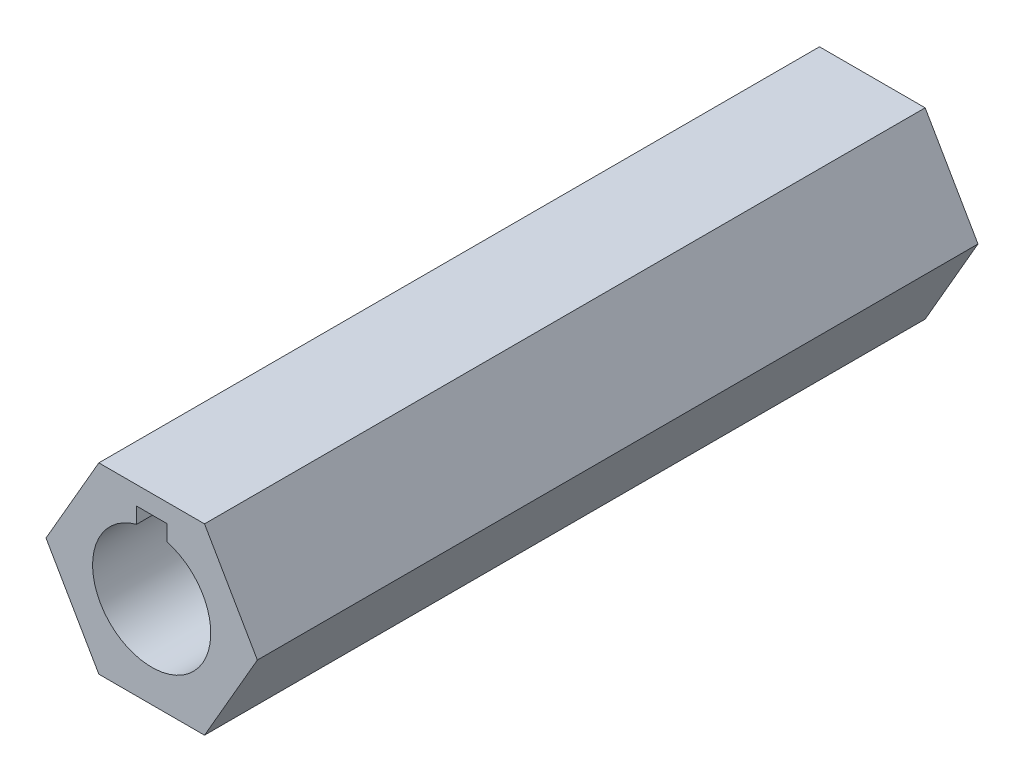
ISO-10303-21;
HEADER;
FILE_DESCRIPTION(('STEP AP214'),'2;1');
FILE_NAME('part.step','',(''),(''),'','','');
FILE_SCHEMA(('AUTOMOTIVE_DESIGN { 1 0 10303 214 1 1 1 1 }'));
ENDSEC;
DATA;
#1=APPLICATION_CONTEXT('core data for automotive mechanical design processes');
#2=APPLICATION_PROTOCOL_DEFINITION('international standard','automotive_design',2000,#1);
#3=PRODUCT_CONTEXT('',#1,'mechanical');
#4=PRODUCT('Part','Part','',(#3));
#5=PRODUCT_RELATED_PRODUCT_CATEGORY('part','',(#4));
#6=PRODUCT_DEFINITION_FORMATION('','',#4);
#7=PRODUCT_DEFINITION_CONTEXT('part definition',#1,'design');
#8=PRODUCT_DEFINITION('design','',#6,#7);
#9=PRODUCT_DEFINITION_SHAPE('','',#8);
#10=(LENGTH_UNIT() NAMED_UNIT(*) SI_UNIT(.MILLI.,.METRE.));
#11=(NAMED_UNIT(*) PLANE_ANGLE_UNIT() SI_UNIT($,.RADIAN.));
#12=(NAMED_UNIT(*) SI_UNIT($,.STERADIAN.) SOLID_ANGLE_UNIT());
#13=UNCERTAINTY_MEASURE_WITH_UNIT(LENGTH_MEASURE(1.E-05),#10,'distance_accuracy_value','');
#14=(GEOMETRIC_REPRESENTATION_CONTEXT(3) GLOBAL_UNCERTAINTY_ASSIGNED_CONTEXT((#13)) GLOBAL_UNIT_ASSIGNED_CONTEXT((#10,
#11,#12)) REPRESENTATION_CONTEXT('',''));
#15=CARTESIAN_POINT('',(0.,0.,0.));
#16=DIRECTION('',(0.,0.,1.));
#17=DIRECTION('',(1.,0.,0.));
#18=AXIS2_PLACEMENT_3D('',#15,#16,#17);
#19=CARTESIAN_POINT('',(3.6661742093542,-6.34999999999996,50.));
#20=DIRECTION('',(-0.866025403784441,0.499999999999995,0.));
#21=DIRECTION('',(-0.499999999999995,-0.866025403784442,0.));
#22=AXIS2_PLACEMENT_3D('',#19,#20,#21);
#23=PLANE('',#22);
#24=DIRECTION('',(0.499999999999995,0.866025403784441,0.));
#25=VECTOR('',#24,1.);
#26=CARTESIAN_POINT('',(3.6661742093542,-6.34999999999996,0.));
#27=LINE('',#26,#25);
#28=CARTESIAN_POINT('',(3.6661742093542,-6.34999999999996,0.));
#29=VERTEX_POINT('',#28);
#30=CARTESIAN_POINT('',(7.33234841870825,0.,0.));
#31=VERTEX_POINT('',#30);
#32=EDGE_CURVE('E149',#29,#31,#27,.T.);
#33=ORIENTED_EDGE('',*,*,#32,.T.);
#34=DIRECTION('',(0.,0.,-1.));
#35=VECTOR('',#34,1.);
#36=CARTESIAN_POINT('',(7.33234841870825,0.,50.));
#37=LINE('',#36,#35);
#38=CARTESIAN_POINT('',(7.33234841870825,0.,50.));
#39=VERTEX_POINT('',#38);
#40=EDGE_CURVE('E11',#39,#31,#37,.T.);
#41=ORIENTED_EDGE('',*,*,#40,.F.);
#42=DIRECTION('',(0.499999999999995,0.866025403784441,0.));
#43=VECTOR('',#42,1.);
#44=CARTESIAN_POINT('',(3.6661742093542,-6.34999999999996,50.));
#45=LINE('',#44,#43);
#46=CARTESIAN_POINT('',(3.6661742093542,-6.34999999999996,50.));
#47=VERTEX_POINT('',#46);
#48=EDGE_CURVE('E155',#47,#39,#45,.T.);
#49=ORIENTED_EDGE('',*,*,#48,.F.);
#50=DIRECTION('',(0.,0.,-1.));
#51=VECTOR('',#50,1.);
#52=CARTESIAN_POINT('',(3.6661742093542,-6.34999999999996,50.));
#53=LINE('',#52,#51);
#54=EDGE_CURVE('E168',#47,#29,#53,.T.);
#55=ORIENTED_EDGE('',*,*,#54,.T.);
#56=EDGE_LOOP('',(#33,#41,#49,#55));
#57=FACE_BOUND('',#56,.T.);
#58=ADVANCED_FACE('F39',(#57),#23,.F.);
#59=CARTESIAN_POINT('',(7.33234841870825,0.,50.));
#60=DIRECTION('',(-0.866025403784438,-0.500000000000001,0.));
#61=DIRECTION('',(0.500000000000001,-0.866025403784438,0.));
#62=AXIS2_PLACEMENT_3D('',#59,#60,#61);
#63=PLANE('',#62);
#64=DIRECTION('',(-0.500000000000001,0.866025403784438,0.));
#65=VECTOR('',#64,1.);
#66=CARTESIAN_POINT('',(7.33234841870825,0.,0.));
#67=LINE('',#66,#65);
#68=CARTESIAN_POINT('',(3.66617420935411,6.35000000000001,0.));
#69=VERTEX_POINT('',#68);
#70=EDGE_CURVE('E170',#31,#69,#67,.T.);
#71=ORIENTED_EDGE('',*,*,#70,.T.);
#72=DIRECTION('',(0.,0.,-1.));
#73=VECTOR('',#72,1.);
#74=CARTESIAN_POINT('',(3.66617420935411,6.35000000000001,50.));
#75=LINE('',#74,#73);
#76=CARTESIAN_POINT('',(3.66617420935411,6.35000000000001,50.));
#77=VERTEX_POINT('',#76);
#78=EDGE_CURVE('E46',#77,#69,#75,.T.);
#79=ORIENTED_EDGE('',*,*,#78,.F.);
#80=DIRECTION('',(-0.500000000000001,0.866025403784438,0.));
#81=VECTOR('',#80,1.);
#82=CARTESIAN_POINT('',(7.33234841870825,0.,50.));
#83=LINE('',#82,#81);
#84=EDGE_CURVE('E154',#39,#77,#83,.T.);
#85=ORIENTED_EDGE('',*,*,#84,.F.);
#86=ORIENTED_EDGE('',*,*,#40,.T.);
#87=EDGE_LOOP('',(#71,#79,#85,#86));
#88=FACE_BOUND('',#87,.T.);
#89=ADVANCED_FACE('F215',(#88),#63,.F.);
#90=CARTESIAN_POINT('',(3.66617420935411,6.35000000000001,50.));
#91=DIRECTION('',(0.,-1.,0.));
#92=DIRECTION('',(1.,0.,0.));
#93=AXIS2_PLACEMENT_3D('',#90,#91,#92);
#94=PLANE('',#93);
#95=DIRECTION('',(-1.,0.,0.));
#96=VECTOR('',#95,1.);
#97=CARTESIAN_POINT('',(3.66617420935411,6.35000000000001,0.));
#98=LINE('',#97,#96);
#99=CARTESIAN_POINT('',(-3.66617420935416,6.34999999999999,0.));
#100=VERTEX_POINT('',#99);
#101=EDGE_CURVE('E173',#69,#100,#98,.T.);
#102=ORIENTED_EDGE('',*,*,#101,.T.);
#103=DIRECTION('',(0.,0.,-1.));
#104=VECTOR('',#103,1.);
#105=CARTESIAN_POINT('',(-3.66617420935416,6.34999999999999,50.));
#106=LINE('',#105,#104);
#107=CARTESIAN_POINT('',(-3.66617420935416,6.34999999999999,50.));
#108=VERTEX_POINT('',#107);
#109=EDGE_CURVE('E186',#108,#100,#106,.T.);
#110=ORIENTED_EDGE('',*,*,#109,.F.);
#111=DIRECTION('',(-1.,0.,0.));
#112=VECTOR('',#111,1.);
#113=CARTESIAN_POINT('',(3.66617420935411,6.35000000000001,50.));
#114=LINE('',#113,#112);
#115=EDGE_CURVE('E156',#77,#108,#114,.T.);
#116=ORIENTED_EDGE('',*,*,#115,.F.);
#117=ORIENTED_EDGE('',*,*,#78,.T.);
#118=EDGE_LOOP('',(#102,#110,#116,#117));
#119=FACE_BOUND('',#118,.T.);
#120=ADVANCED_FACE('F194',(#119),#94,.F.);
#121=CARTESIAN_POINT('',(-3.66617420935416,6.34999999999999,50.));
#122=DIRECTION('',(0.866025403784442,-0.499999999999995,0.));
#123=DIRECTION('',(0.499999999999995,0.866025403784442,0.));
#124=AXIS2_PLACEMENT_3D('',#121,#122,#123);
#125=PLANE('',#124);
#126=DIRECTION('',(-0.499999999999995,-0.866025403784441,0.));
#127=VECTOR('',#126,1.);
#128=CARTESIAN_POINT('',(-3.66617420935416,6.34999999999999,0.));
#129=LINE('',#128,#127);
#130=CARTESIAN_POINT('',(-7.33234841870825,0.,0.));
#131=VERTEX_POINT('',#130);
#132=EDGE_CURVE('E171',#100,#131,#129,.T.);
#133=ORIENTED_EDGE('',*,*,#132,.T.);
#134=DIRECTION('',(0.,0.,-1.));
#135=VECTOR('',#134,1.);
#136=CARTESIAN_POINT('',(-7.33234841870825,0.,50.));
#137=LINE('',#136,#135);
#138=CARTESIAN_POINT('',(-7.33234841870825,0.,50.));
#139=VERTEX_POINT('',#138);
#140=EDGE_CURVE('E183',#139,#131,#137,.T.);
#141=ORIENTED_EDGE('',*,*,#140,.F.);
#142=DIRECTION('',(-0.499999999999995,-0.866025403784441,0.));
#143=VECTOR('',#142,1.);
#144=CARTESIAN_POINT('',(-3.66617420935416,6.34999999999999,50.));
#145=LINE('',#144,#143);
#146=EDGE_CURVE('E158',#108,#139,#145,.T.);
#147=ORIENTED_EDGE('',*,*,#146,.F.);
#148=ORIENTED_EDGE('',*,*,#109,.T.);
#149=EDGE_LOOP('',(#133,#141,#147,#148));
#150=FACE_BOUND('',#149,.T.);
#151=ADVANCED_FACE('F205',(#150),#125,.F.);
#152=CARTESIAN_POINT('',(-7.33234841870825,0.,50.));
#153=DIRECTION('',(0.866025403784435,0.500000000000007,0.));
#154=DIRECTION('',(-0.500000000000007,0.866025403784435,0.));
#155=AXIS2_PLACEMENT_3D('',#152,#153,#154);
#156=PLANE('',#155);
#157=DIRECTION('',(0.500000000000007,-0.866025403784435,0.));
#158=VECTOR('',#157,1.);
#159=CARTESIAN_POINT('',(-7.33234841870825,0.,0.));
#160=LINE('',#159,#158);
#161=CARTESIAN_POINT('',(-3.66617420935407,-6.35000000000004,0.));
#162=VERTEX_POINT('',#161);
#163=EDGE_CURVE('E172',#131,#162,#160,.T.);
#164=ORIENTED_EDGE('',*,*,#163,.T.);
#165=DIRECTION('',(0.,0.,-1.));
#166=VECTOR('',#165,1.);
#167=CARTESIAN_POINT('',(-3.66617420935407,-6.35000000000004,50.));
#168=LINE('',#167,#166);
#169=CARTESIAN_POINT('',(-3.66617420935407,-6.35000000000004,50.));
#170=VERTEX_POINT('',#169);
#171=EDGE_CURVE('E179',#170,#162,#168,.T.);
#172=ORIENTED_EDGE('',*,*,#171,.F.);
#173=DIRECTION('',(0.500000000000007,-0.866025403784435,0.));
#174=VECTOR('',#173,1.);
#175=CARTESIAN_POINT('',(-7.33234841870825,0.,50.));
#176=LINE('',#175,#174);
#177=EDGE_CURVE('E165',#139,#170,#176,.T.);
#178=ORIENTED_EDGE('',*,*,#177,.F.);
#179=ORIENTED_EDGE('',*,*,#140,.T.);
#180=EDGE_LOOP('',(#164,#172,#178,#179));
#181=FACE_BOUND('',#180,.T.);
#182=ADVANCED_FACE('F208',(#181),#156,.F.);
#183=CARTESIAN_POINT('',(-3.66617420935407,-6.35000000000004,50.));
#184=DIRECTION('',(0.,1.,0.));
#185=DIRECTION('',(-1.,0.,0.));
#186=AXIS2_PLACEMENT_3D('',#183,#184,#185);
#187=PLANE('',#186);
#188=DIRECTION('',(1.,0.,0.));
#189=VECTOR('',#188,1.);
#190=CARTESIAN_POINT('',(-3.66617420935407,-6.35000000000004,0.));
#191=LINE('',#190,#189);
#192=EDGE_CURVE('E157',#162,#29,#191,.T.);
#193=ORIENTED_EDGE('',*,*,#192,.T.);
#194=ORIENTED_EDGE('',*,*,#54,.F.);
#195=DIRECTION('',(1.,0.,0.));
#196=VECTOR('',#195,1.);
#197=CARTESIAN_POINT('',(-3.66617420935407,-6.35000000000004,50.));
#198=LINE('',#197,#196);
#199=EDGE_CURVE('E162',#170,#47,#198,.T.);
#200=ORIENTED_EDGE('',*,*,#199,.F.);
#201=ORIENTED_EDGE('',*,*,#171,.T.);
#202=EDGE_LOOP('',(#193,#194,#200,#201));
#203=FACE_BOUND('',#202,.T.);
#204=ADVANCED_FACE('F220',(#203),#187,.F.);
#205=CARTESIAN_POINT('',(0.,0.,50.));
#206=DIRECTION('',(0.,0.,1.));
#207=DIRECTION('',(1.,0.,0.));
#208=AXIS2_PLACEMENT_3D('',#205,#206,#207);
#209=PLANE('',#208);
#210=CARTESIAN_POINT('',(0.,0.,50.));
#211=DIRECTION('',(0.,0.,1.));
#212=DIRECTION('',(1.,0.,0.));
#213=AXIS2_PLACEMENT_3D('',#210,#211,#212);
#214=CIRCLE('',#213,4.1);
#215=CARTESIAN_POINT('',(-1.04888140629234,3.96356503611764,50.));
#216=VERTEX_POINT('',#215);
#217=CARTESIAN_POINT('',(1.05111859370766,3.96297233171795,50.));
#218=VERTEX_POINT('',#217);
#219=EDGE_CURVE('E52',#216,#218,#214,.T.);
#220=ORIENTED_EDGE('',*,*,#219,.F.);
#221=DIRECTION('',(0.,-1.,0.));
#222=VECTOR('',#221,1.);
#223=CARTESIAN_POINT('',(-1.04888140629234,3.96356503611764,50.));
#224=LINE('',#223,#222);
#225=CARTESIAN_POINT('',(-1.04888140629234,5.06297233171795,50.));
#226=VERTEX_POINT('',#225);
#227=EDGE_CURVE('E133',#226,#216,#224,.T.);
#228=ORIENTED_EDGE('',*,*,#227,.F.);
#229=DIRECTION('',(-1.,0.,0.));
#230=VECTOR('',#229,1.);
#231=CARTESIAN_POINT('',(-1.04888140629234,5.06297233171795,50.));
#232=LINE('',#231,#230);
#233=CARTESIAN_POINT('',(1.05111859370766,5.06297233171795,50.));
#234=VERTEX_POINT('',#233);
#235=EDGE_CURVE('E136',#234,#226,#232,.T.);
#236=ORIENTED_EDGE('',*,*,#235,.F.);
#237=DIRECTION('',(0.,1.,0.));
#238=VECTOR('',#237,1.);
#239=CARTESIAN_POINT('',(1.05111859370766,5.06297233171795,50.));
#240=LINE('',#239,#238);
#241=EDGE_CURVE('E145',#218,#234,#240,.T.);
#242=ORIENTED_EDGE('',*,*,#241,.F.);
#243=EDGE_LOOP('',(#220,#228,#236,#242));
#244=FACE_BOUND('',#243,.T.);
#245=ORIENTED_EDGE('',*,*,#48,.T.);
#246=ORIENTED_EDGE('',*,*,#84,.T.);
#247=ORIENTED_EDGE('',*,*,#115,.T.);
#248=ORIENTED_EDGE('',*,*,#146,.T.);
#249=ORIENTED_EDGE('',*,*,#177,.T.);
#250=ORIENTED_EDGE('',*,*,#199,.T.);
#251=EDGE_LOOP('',(#245,#246,#247,#248,#249,#250));
#252=FACE_BOUND('',#251,.T.);
#253=ADVANCED_FACE('F209',(#244,#252),#209,.T.);
#254=CARTESIAN_POINT('',(0.,0.,0.));
#255=DIRECTION('',(0.,0.,1.));
#256=DIRECTION('',(1.,0.,0.));
#257=AXIS2_PLACEMENT_3D('',#254,#255,#256);
#258=PLANE('',#257);
#259=DIRECTION('',(0.,-1.,0.));
#260=VECTOR('',#259,1.);
#261=CARTESIAN_POINT('',(-1.04888140629234,3.96356503611764,0.));
#262=LINE('',#261,#260);
#263=CARTESIAN_POINT('',(-1.04888140629234,5.06297233171795,0.));
#264=VERTEX_POINT('',#263);
#265=CARTESIAN_POINT('',(-1.04888140629234,3.96356503611764,0.));
#266=VERTEX_POINT('',#265);
#267=EDGE_CURVE('E121',#264,#266,#262,.T.);
#268=ORIENTED_EDGE('',*,*,#267,.T.);
#269=CARTESIAN_POINT('',(0.,0.,0.));
#270=DIRECTION('',(0.,0.,1.));
#271=DIRECTION('',(1.,0.,0.));
#272=AXIS2_PLACEMENT_3D('',#269,#270,#271);
#273=CIRCLE('',#272,4.1);
#274=CARTESIAN_POINT('',(1.05111859370766,3.96297233171795,0.));
#275=VERTEX_POINT('',#274);
#276=EDGE_CURVE('E120',#266,#275,#273,.T.);
#277=ORIENTED_EDGE('',*,*,#276,.T.);
#278=DIRECTION('',(0.,1.,0.));
#279=VECTOR('',#278,1.);
#280=CARTESIAN_POINT('',(1.05111859370766,5.06297233171795,0.));
#281=LINE('',#280,#279);
#282=CARTESIAN_POINT('',(1.05111859370766,5.06297233171795,0.));
#283=VERTEX_POINT('',#282);
#284=EDGE_CURVE('E128',#275,#283,#281,.T.);
#285=ORIENTED_EDGE('',*,*,#284,.T.);
#286=DIRECTION('',(-1.,0.,0.));
#287=VECTOR('',#286,1.);
#288=CARTESIAN_POINT('',(-1.04888140629234,5.06297233171795,0.));
#289=LINE('',#288,#287);
#290=EDGE_CURVE('E63',#283,#264,#289,.T.);
#291=ORIENTED_EDGE('',*,*,#290,.T.);
#292=EDGE_LOOP('',(#268,#277,#285,#291));
#293=FACE_BOUND('',#292,.T.);
#294=ORIENTED_EDGE('',*,*,#32,.F.);
#295=ORIENTED_EDGE('',*,*,#192,.F.);
#296=ORIENTED_EDGE('',*,*,#163,.F.);
#297=ORIENTED_EDGE('',*,*,#132,.F.);
#298=ORIENTED_EDGE('',*,*,#101,.F.);
#299=ORIENTED_EDGE('',*,*,#70,.F.);
#300=EDGE_LOOP('',(#294,#295,#296,#297,#298,#299));
#301=FACE_BOUND('',#300,.T.);
#302=ADVANCED_FACE('F127',(#293,#301),#258,.F.);
#303=CARTESIAN_POINT('',(0.,0.,0.));
#304=DIRECTION('',(0.,0.,1.));
#305=DIRECTION('',(1.,0.,0.));
#306=AXIS2_PLACEMENT_3D('',#303,#304,#305);
#307=CYLINDRICAL_SURFACE('',#306,4.1);
#308=ORIENTED_EDGE('',*,*,#219,.T.);
#309=DIRECTION('',(0.,0.,1.));
#310=VECTOR('',#309,1.);
#311=CARTESIAN_POINT('',(1.05111859370766,3.96297233171795,0.));
#312=LINE('',#311,#310);
#313=EDGE_CURVE('E111',#275,#218,#312,.T.);
#314=ORIENTED_EDGE('',*,*,#313,.F.);
#315=ORIENTED_EDGE('',*,*,#276,.F.);
#316=DIRECTION('',(0.,0.,1.));
#317=VECTOR('',#316,1.);
#318=CARTESIAN_POINT('',(-1.04888140629234,3.96356503611764,0.));
#319=LINE('',#318,#317);
#320=EDGE_CURVE('E147',#266,#216,#319,.T.);
#321=ORIENTED_EDGE('',*,*,#320,.T.);
#322=EDGE_LOOP('',(#308,#314,#315,#321));
#323=FACE_BOUND('',#322,.T.);
#324=ADVANCED_FACE('F113',(#323),#307,.F.);
#325=CARTESIAN_POINT('',(-1.04888140629234,3.96356503611764,0.));
#326=DIRECTION('',(-1.,0.,0.));
#327=DIRECTION('',(0.,-1.,0.));
#328=AXIS2_PLACEMENT_3D('',#325,#326,#327);
#329=PLANE('',#328);
#330=ORIENTED_EDGE('',*,*,#227,.T.);
#331=ORIENTED_EDGE('',*,*,#320,.F.);
#332=ORIENTED_EDGE('',*,*,#267,.F.);
#333=DIRECTION('',(0.,0.,1.));
#334=VECTOR('',#333,1.);
#335=CARTESIAN_POINT('',(-1.04888140629234,5.06297233171795,0.));
#336=LINE('',#335,#334);
#337=EDGE_CURVE('E146',#264,#226,#336,.T.);
#338=ORIENTED_EDGE('',*,*,#337,.T.);
#339=EDGE_LOOP('',(#330,#331,#332,#338));
#340=FACE_BOUND('',#339,.T.);
#341=ADVANCED_FACE('F272',(#340),#329,.F.);
#342=CARTESIAN_POINT('',(-1.04888140629234,5.06297233171795,0.));
#343=DIRECTION('',(0.,1.,0.));
#344=DIRECTION('',(-1.,0.,0.));
#345=AXIS2_PLACEMENT_3D('',#342,#343,#344);
#346=PLANE('',#345);
#347=ORIENTED_EDGE('',*,*,#235,.T.);
#348=ORIENTED_EDGE('',*,*,#337,.F.);
#349=ORIENTED_EDGE('',*,*,#290,.F.);
#350=DIRECTION('',(0.,0.,1.));
#351=VECTOR('',#350,1.);
#352=CARTESIAN_POINT('',(1.05111859370766,5.06297233171795,0.));
#353=LINE('',#352,#351);
#354=EDGE_CURVE('E122',#283,#234,#353,.T.);
#355=ORIENTED_EDGE('',*,*,#354,.T.);
#356=EDGE_LOOP('',(#347,#348,#349,#355));
#357=FACE_BOUND('',#356,.T.);
#358=ADVANCED_FACE('F284',(#357),#346,.F.);
#359=CARTESIAN_POINT('',(1.05111859370766,5.06297233171795,0.));
#360=DIRECTION('',(1.,0.,0.));
#361=DIRECTION('',(0.,1.,0.));
#362=AXIS2_PLACEMENT_3D('',#359,#360,#361);
#363=PLANE('',#362);
#364=ORIENTED_EDGE('',*,*,#241,.T.);
#365=ORIENTED_EDGE('',*,*,#354,.F.);
#366=ORIENTED_EDGE('',*,*,#284,.F.);
#367=ORIENTED_EDGE('',*,*,#313,.T.);
#368=EDGE_LOOP('',(#364,#365,#366,#367));
#369=FACE_BOUND('',#368,.T.);
#370=ADVANCED_FACE('F130',(#369),#363,.F.);
#371=CLOSED_SHELL('',(#58,#89,#120,#151,#182,#204,#253,#302,#324,#341,#358,#370));
#372=MANIFOLD_SOLID_BREP('B2',#371);
#373=ADVANCED_BREP_SHAPE_REPRESENTATION('',(#18,#372),#14);
#374=SHAPE_DEFINITION_REPRESENTATION(#9,#373);
ENDSEC;
END-ISO-10303-21;
